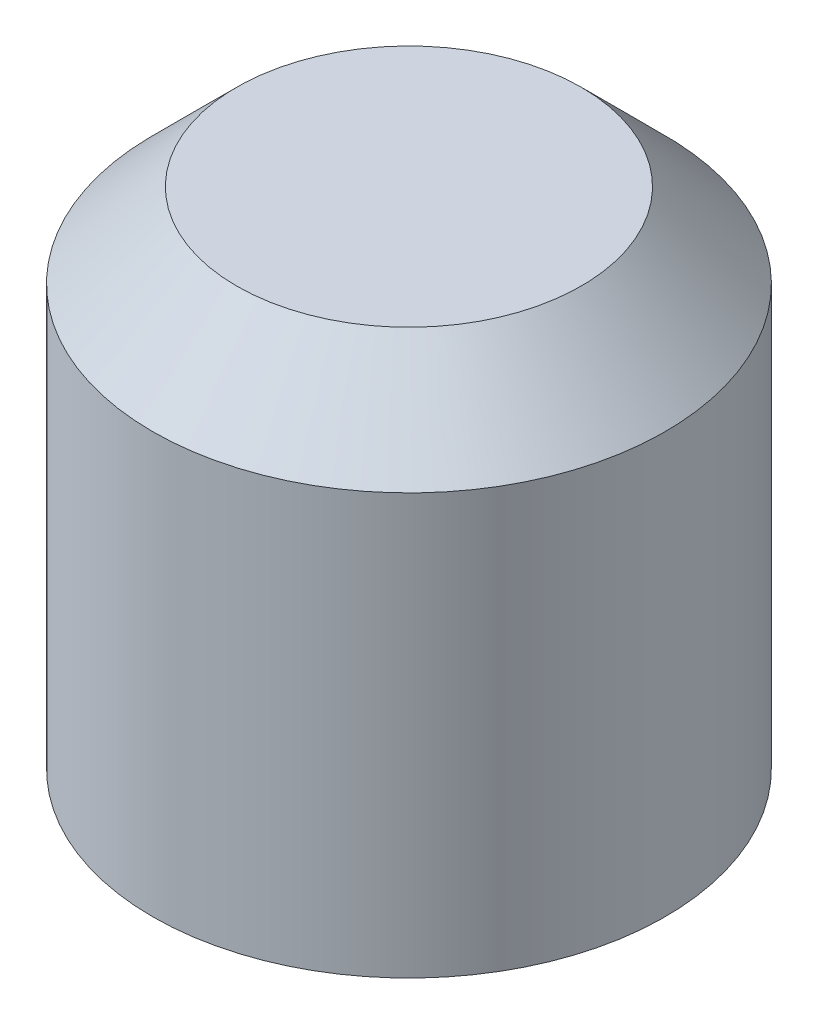
ISO-10303-21;
HEADER;
FILE_DESCRIPTION(('STEP AP214'),'2;1');
FILE_NAME('part.step','',(''),(''),'','','');
FILE_SCHEMA(('AUTOMOTIVE_DESIGN { 1 0 10303 214 1 1 1 1 }'));
ENDSEC;
DATA;
#1=APPLICATION_CONTEXT('core data for automotive mechanical design processes');
#2=APPLICATION_PROTOCOL_DEFINITION('international standard','automotive_design',2000,#1);
#3=PRODUCT_CONTEXT('',#1,'mechanical');
#4=PRODUCT('Part','Part','',(#3));
#5=PRODUCT_RELATED_PRODUCT_CATEGORY('part','',(#4));
#6=PRODUCT_DEFINITION_FORMATION('','',#4);
#7=PRODUCT_DEFINITION_CONTEXT('part definition',#1,'design');
#8=PRODUCT_DEFINITION('design','',#6,#7);
#9=PRODUCT_DEFINITION_SHAPE('','',#8);
#10=(LENGTH_UNIT() NAMED_UNIT(*) SI_UNIT(.MILLI.,.METRE.));
#11=(NAMED_UNIT(*) PLANE_ANGLE_UNIT() SI_UNIT($,.RADIAN.));
#12=(NAMED_UNIT(*) SI_UNIT($,.STERADIAN.) SOLID_ANGLE_UNIT());
#13=UNCERTAINTY_MEASURE_WITH_UNIT(LENGTH_MEASURE(1.E-05),#10,'distance_accuracy_value','');
#14=(GEOMETRIC_REPRESENTATION_CONTEXT(3) GLOBAL_UNCERTAINTY_ASSIGNED_CONTEXT((#13)) GLOBAL_UNIT_ASSIGNED_CONTEXT((#10,
#11,#12)) REPRESENTATION_CONTEXT('',''));
#15=CARTESIAN_POINT('',(0.,0.,0.));
#16=DIRECTION('',(0.,0.,1.));
#17=DIRECTION('',(1.,0.,0.));
#18=AXIS2_PLACEMENT_3D('',#15,#16,#17);
#19=CARTESIAN_POINT('',(0.,3.,0.));
#20=DIRECTION('',(0.,-1.,0.));
#21=DIRECTION('',(0.,0.,-1.));
#22=AXIS2_PLACEMENT_3D('',#19,#20,#21);
#23=CYLINDRICAL_SURFACE('',#22,1.525);
#24=CARTESIAN_POINT('',(0.,2.5,0.));
#25=DIRECTION('',(0.,1.,0.));
#26=DIRECTION('',(0.,0.,1.));
#27=AXIS2_PLACEMENT_3D('',#24,#25,#26);
#28=CIRCLE('',#27,1.525);
#29=CARTESIAN_POINT('',(0.,2.5,1.525));
#30=VERTEX_POINT('',#29);
#31=EDGE_CURVE('E10',#30,#30,#28,.F.);
#32=ORIENTED_EDGE('',*,*,#31,.T.);
#33=EDGE_LOOP('',(#32));
#34=FACE_BOUND('',#33,.T.);
#35=CARTESIAN_POINT('',(0.,0.,0.));
#36=DIRECTION('',(0.,1.,0.));
#37=DIRECTION('',(0.,0.,1.));
#38=AXIS2_PLACEMENT_3D('',#35,#36,#37);
#39=CIRCLE('',#38,1.525);
#40=CARTESIAN_POINT('',(0.,0.,1.525));
#41=VERTEX_POINT('',#40);
#42=EDGE_CURVE('E55',#41,#41,#39,.T.);
#43=ORIENTED_EDGE('',*,*,#42,.T.);
#44=EDGE_LOOP('',(#43));
#45=FACE_BOUND('',#44,.T.);
#46=ADVANCED_FACE('F43',(#34,#45),#23,.T.);
#47=CARTESIAN_POINT('',(0.,3.,0.));
#48=DIRECTION('',(0.,1.,0.));
#49=DIRECTION('',(0.,0.,1.));
#50=AXIS2_PLACEMENT_3D('',#47,#48,#49);
#51=PLANE('',#50);
#52=CARTESIAN_POINT('',(0.,3.,0.));
#53=DIRECTION('',(0.,1.,0.));
#54=DIRECTION('',(0.,0.,1.));
#55=AXIS2_PLACEMENT_3D('',#52,#53,#54);
#56=CIRCLE('',#55,1.025);
#57=CARTESIAN_POINT('',(0.,3.,1.025));
#58=VERTEX_POINT('',#57);
#59=EDGE_CURVE('E51',#58,#58,#56,.T.);
#60=ORIENTED_EDGE('',*,*,#59,.T.);
#61=EDGE_LOOP('',(#60));
#62=FACE_BOUND('',#61,.T.);
#63=ADVANCED_FACE('F65',(#62),#51,.T.);
#64=CARTESIAN_POINT('',(0.,0.,0.));
#65=DIRECTION('',(0.,1.,0.));
#66=DIRECTION('',(0.,0.,1.));
#67=AXIS2_PLACEMENT_3D('',#64,#65,#66);
#68=PLANE('',#67);
#69=ORIENTED_EDGE('',*,*,#42,.F.);
#70=EDGE_LOOP('',(#69));
#71=FACE_BOUND('',#70,.T.);
#72=ADVANCED_FACE('F63',(#71),#68,.F.);
#73=CARTESIAN_POINT('',(0.,3.,0.));
#74=DIRECTION('',(0.,-1.,0.));
#75=DIRECTION('',(0.,0.,-1.));
#76=AXIS2_PLACEMENT_3D('',#73,#74,#75);
#77=CONICAL_SURFACE('',#76,1.025,0.785398163397447);
#78=ORIENTED_EDGE('',*,*,#31,.F.);
#79=EDGE_LOOP('',(#78));
#80=FACE_BOUND('',#79,.T.);
#81=ORIENTED_EDGE('',*,*,#59,.F.);
#82=EDGE_LOOP('',(#81));
#83=FACE_BOUND('',#82,.T.);
#84=ADVANCED_FACE('F46',(#80,#83),#77,.T.);
#85=CLOSED_SHELL('',(#46,#63,#72,#84));
#86=MANIFOLD_SOLID_BREP('B2',#85);
#87=ADVANCED_BREP_SHAPE_REPRESENTATION('',(#18,#86),#14);
#88=SHAPE_DEFINITION_REPRESENTATION(#9,#87);
ENDSEC;
END-ISO-10303-21;
